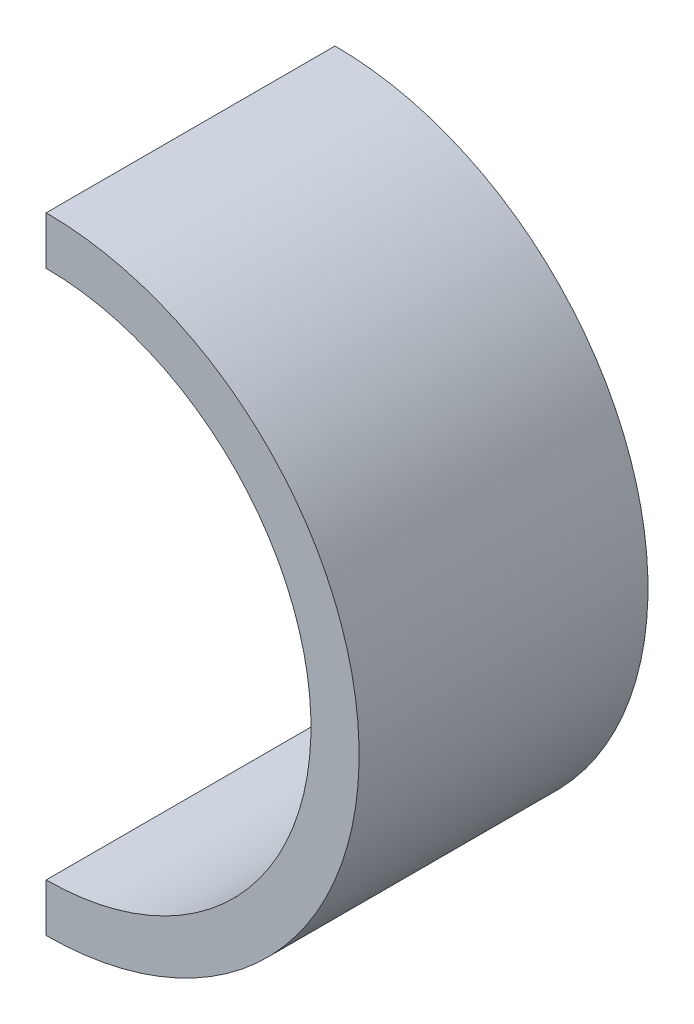
ISO-10303-21;
HEADER;
FILE_DESCRIPTION(('STEP AP214'),'2;1');
FILE_NAME('part.step','',(''),(''),'','','');
FILE_SCHEMA(('AUTOMOTIVE_DESIGN { 1 0 10303 214 1 1 1 1 }'));
ENDSEC;
DATA;
#1=APPLICATION_CONTEXT('core data for automotive mechanical design processes');
#2=APPLICATION_PROTOCOL_DEFINITION('international standard','automotive_design',2000,#1);
#3=PRODUCT_CONTEXT('',#1,'mechanical');
#4=PRODUCT('Part','Part','',(#3));
#5=PRODUCT_RELATED_PRODUCT_CATEGORY('part','',(#4));
#6=PRODUCT_DEFINITION_FORMATION('','',#4);
#7=PRODUCT_DEFINITION_CONTEXT('part definition',#1,'design');
#8=PRODUCT_DEFINITION('design','',#6,#7);
#9=PRODUCT_DEFINITION_SHAPE('','',#8);
#10=(LENGTH_UNIT() NAMED_UNIT(*) SI_UNIT(.MILLI.,.METRE.));
#11=(NAMED_UNIT(*) PLANE_ANGLE_UNIT() SI_UNIT($,.RADIAN.));
#12=(NAMED_UNIT(*) SI_UNIT($,.STERADIAN.) SOLID_ANGLE_UNIT());
#13=UNCERTAINTY_MEASURE_WITH_UNIT(LENGTH_MEASURE(1.E-05),#10,'distance_accuracy_value','');
#14=(GEOMETRIC_REPRESENTATION_CONTEXT(3) GLOBAL_UNCERTAINTY_ASSIGNED_CONTEXT((#13)) GLOBAL_UNIT_ASSIGNED_CONTEXT((#10,
#11,#12)) REPRESENTATION_CONTEXT('',''));
#15=CARTESIAN_POINT('',(0.,0.,0.));
#16=DIRECTION('',(0.,0.,1.));
#17=DIRECTION('',(1.,0.,0.));
#18=AXIS2_PLACEMENT_3D('',#15,#16,#17);
#19=CARTESIAN_POINT('',(0.,0.,30.));
#20=DIRECTION('',(0.,0.,-1.));
#21=DIRECTION('',(-1.,0.,0.));
#22=AXIS2_PLACEMENT_3D('',#19,#20,#21);
#23=CYLINDRICAL_SURFACE('',#22,32.5);
#24=CARTESIAN_POINT('',(0.,0.,0.));
#25=DIRECTION('',(0.,0.,1.));
#26=DIRECTION('',(1.,0.,0.));
#27=AXIS2_PLACEMENT_3D('',#24,#25,#26);
#28=CIRCLE('',#27,32.5);
#29=CARTESIAN_POINT('',(0.,-32.5,0.));
#30=VERTEX_POINT('',#29);
#31=CARTESIAN_POINT('',(0.,32.5,0.));
#32=VERTEX_POINT('',#31);
#33=EDGE_CURVE('E107',#30,#32,#28,.T.);
#34=ORIENTED_EDGE('',*,*,#33,.T.);
#35=DIRECTION('',(0.,0.,-1.));
#36=VECTOR('',#35,1.);
#37=CARTESIAN_POINT('',(0.,32.5,30.));
#38=LINE('',#37,#36);
#39=CARTESIAN_POINT('',(0.,32.5,30.));
#40=VERTEX_POINT('',#39);
#41=EDGE_CURVE('E11',#40,#32,#38,.T.);
#42=ORIENTED_EDGE('',*,*,#41,.F.);
#43=CARTESIAN_POINT('',(0.,0.,30.));
#44=DIRECTION('',(0.,0.,1.));
#45=DIRECTION('',(1.,0.,0.));
#46=AXIS2_PLACEMENT_3D('',#43,#44,#45);
#47=CIRCLE('',#46,32.5);
#48=CARTESIAN_POINT('',(0.,-32.5,30.));
#49=VERTEX_POINT('',#48);
#50=EDGE_CURVE('E91',#49,#40,#47,.T.);
#51=ORIENTED_EDGE('',*,*,#50,.F.);
#52=DIRECTION('',(0.,0.,-1.));
#53=VECTOR('',#52,1.);
#54=CARTESIAN_POINT('',(0.,-32.5,30.));
#55=LINE('',#54,#53);
#56=EDGE_CURVE('E103',#49,#30,#55,.T.);
#57=ORIENTED_EDGE('',*,*,#56,.T.);
#58=EDGE_LOOP('',(#34,#42,#51,#57));
#59=FACE_BOUND('',#58,.T.);
#60=ADVANCED_FACE('F39',(#59),#23,.T.);
#61=CARTESIAN_POINT('',(0.,32.5,30.));
#62=DIRECTION('',(1.,0.,0.));
#63=DIRECTION('',(0.,1.,0.));
#64=AXIS2_PLACEMENT_3D('',#61,#62,#63);
#65=PLANE('',#64);
#66=DIRECTION('',(0.,-1.,0.));
#67=VECTOR('',#66,1.);
#68=CARTESIAN_POINT('',(0.,32.5,0.));
#69=LINE('',#68,#67);
#70=CARTESIAN_POINT('',(0.,27.5,0.));
#71=VERTEX_POINT('',#70);
#72=EDGE_CURVE('E96',#32,#71,#69,.T.);
#73=ORIENTED_EDGE('',*,*,#72,.T.);
#74=DIRECTION('',(0.,0.,-1.));
#75=VECTOR('',#74,1.);
#76=CARTESIAN_POINT('',(0.,27.5,30.));
#77=LINE('',#76,#75);
#78=CARTESIAN_POINT('',(0.,27.5,30.));
#79=VERTEX_POINT('',#78);
#80=EDGE_CURVE('E48',#79,#71,#77,.T.);
#81=ORIENTED_EDGE('',*,*,#80,.F.);
#82=DIRECTION('',(0.,-1.,0.));
#83=VECTOR('',#82,1.);
#84=CARTESIAN_POINT('',(0.,32.5,30.));
#85=LINE('',#84,#83);
#86=EDGE_CURVE('E86',#40,#79,#85,.T.);
#87=ORIENTED_EDGE('',*,*,#86,.F.);
#88=ORIENTED_EDGE('',*,*,#41,.T.);
#89=EDGE_LOOP('',(#73,#81,#87,#88));
#90=FACE_BOUND('',#89,.T.);
#91=ADVANCED_FACE('F95',(#90),#65,.F.);
#92=CARTESIAN_POINT('',(0.,0.,30.));
#93=DIRECTION('',(0.,0.,-1.));
#94=DIRECTION('',(-1.,0.,0.));
#95=AXIS2_PLACEMENT_3D('',#92,#93,#94);
#96=CYLINDRICAL_SURFACE('',#95,27.5);
#97=CARTESIAN_POINT('',(0.,0.,0.));
#98=DIRECTION('',(0.,0.,-1.));
#99=DIRECTION('',(1.,0.,0.));
#100=AXIS2_PLACEMENT_3D('',#97,#98,#99);
#101=CIRCLE('',#100,27.5);
#102=CARTESIAN_POINT('',(0.,-27.5,0.));
#103=VERTEX_POINT('',#102);
#104=EDGE_CURVE('E73',#71,#103,#101,.T.);
#105=ORIENTED_EDGE('',*,*,#104,.T.);
#106=DIRECTION('',(0.,0.,-1.));
#107=VECTOR('',#106,1.);
#108=CARTESIAN_POINT('',(0.,-27.5,30.));
#109=LINE('',#108,#107);
#110=CARTESIAN_POINT('',(0.,-27.5,30.));
#111=VERTEX_POINT('',#110);
#112=EDGE_CURVE('E98',#111,#103,#109,.T.);
#113=ORIENTED_EDGE('',*,*,#112,.F.);
#114=CARTESIAN_POINT('',(0.,0.,30.));
#115=DIRECTION('',(0.,0.,-1.));
#116=DIRECTION('',(1.,0.,0.));
#117=AXIS2_PLACEMENT_3D('',#114,#115,#116);
#118=CIRCLE('',#117,27.5);
#119=EDGE_CURVE('E89',#79,#111,#118,.T.);
#120=ORIENTED_EDGE('',*,*,#119,.F.);
#121=ORIENTED_EDGE('',*,*,#80,.T.);
#122=EDGE_LOOP('',(#105,#113,#120,#121));
#123=FACE_BOUND('',#122,.T.);
#124=ADVANCED_FACE('F99',(#123),#96,.F.);
#125=CARTESIAN_POINT('',(0.,-32.5,30.));
#126=DIRECTION('',(1.,0.,0.));
#127=DIRECTION('',(0.,1.,0.));
#128=AXIS2_PLACEMENT_3D('',#125,#126,#127);
#129=PLANE('',#128);
#130=DIRECTION('',(0.,-1.,0.));
#131=VECTOR('',#130,1.);
#132=CARTESIAN_POINT('',(0.,-32.5,0.));
#133=LINE('',#132,#131);
#134=EDGE_CURVE('E79',#103,#30,#133,.T.);
#135=ORIENTED_EDGE('',*,*,#134,.T.);
#136=ORIENTED_EDGE('',*,*,#56,.F.);
#137=DIRECTION('',(0.,-1.,0.));
#138=VECTOR('',#137,1.);
#139=CARTESIAN_POINT('',(0.,-32.5,30.));
#140=LINE('',#139,#138);
#141=EDGE_CURVE('E56',#111,#49,#140,.T.);
#142=ORIENTED_EDGE('',*,*,#141,.F.);
#143=ORIENTED_EDGE('',*,*,#112,.T.);
#144=EDGE_LOOP('',(#135,#136,#142,#143));
#145=FACE_BOUND('',#144,.T.);
#146=ADVANCED_FACE('F120',(#145),#129,.F.);
#147=CARTESIAN_POINT('',(0.,0.,30.));
#148=DIRECTION('',(0.,0.,1.));
#149=DIRECTION('',(1.,0.,0.));
#150=AXIS2_PLACEMENT_3D('',#147,#148,#149);
#151=PLANE('',#150);
#152=ORIENTED_EDGE('',*,*,#50,.T.);
#153=ORIENTED_EDGE('',*,*,#86,.T.);
#154=ORIENTED_EDGE('',*,*,#119,.T.);
#155=ORIENTED_EDGE('',*,*,#141,.T.);
#156=EDGE_LOOP('',(#152,#153,#154,#155));
#157=FACE_BOUND('',#156,.T.);
#158=ADVANCED_FACE('F87',(#157),#151,.T.);
#159=CARTESIAN_POINT('',(0.,0.,0.));
#160=DIRECTION('',(0.,0.,1.));
#161=DIRECTION('',(1.,0.,0.));
#162=AXIS2_PLACEMENT_3D('',#159,#160,#161);
#163=PLANE('',#162);
#164=ORIENTED_EDGE('',*,*,#33,.F.);
#165=ORIENTED_EDGE('',*,*,#134,.F.);
#166=ORIENTED_EDGE('',*,*,#104,.F.);
#167=ORIENTED_EDGE('',*,*,#72,.F.);
#168=EDGE_LOOP('',(#164,#165,#166,#167));
#169=FACE_BOUND('',#168,.T.);
#170=ADVANCED_FACE('F123',(#169),#163,.F.);
#171=CLOSED_SHELL('',(#60,#91,#124,#146,#158,#170));
#172=MANIFOLD_SOLID_BREP('B2',#171);
#173=ADVANCED_BREP_SHAPE_REPRESENTATION('',(#18,#172),#14);
#174=SHAPE_DEFINITION_REPRESENTATION(#9,#173);
ENDSEC;
END-ISO-10303-21;
